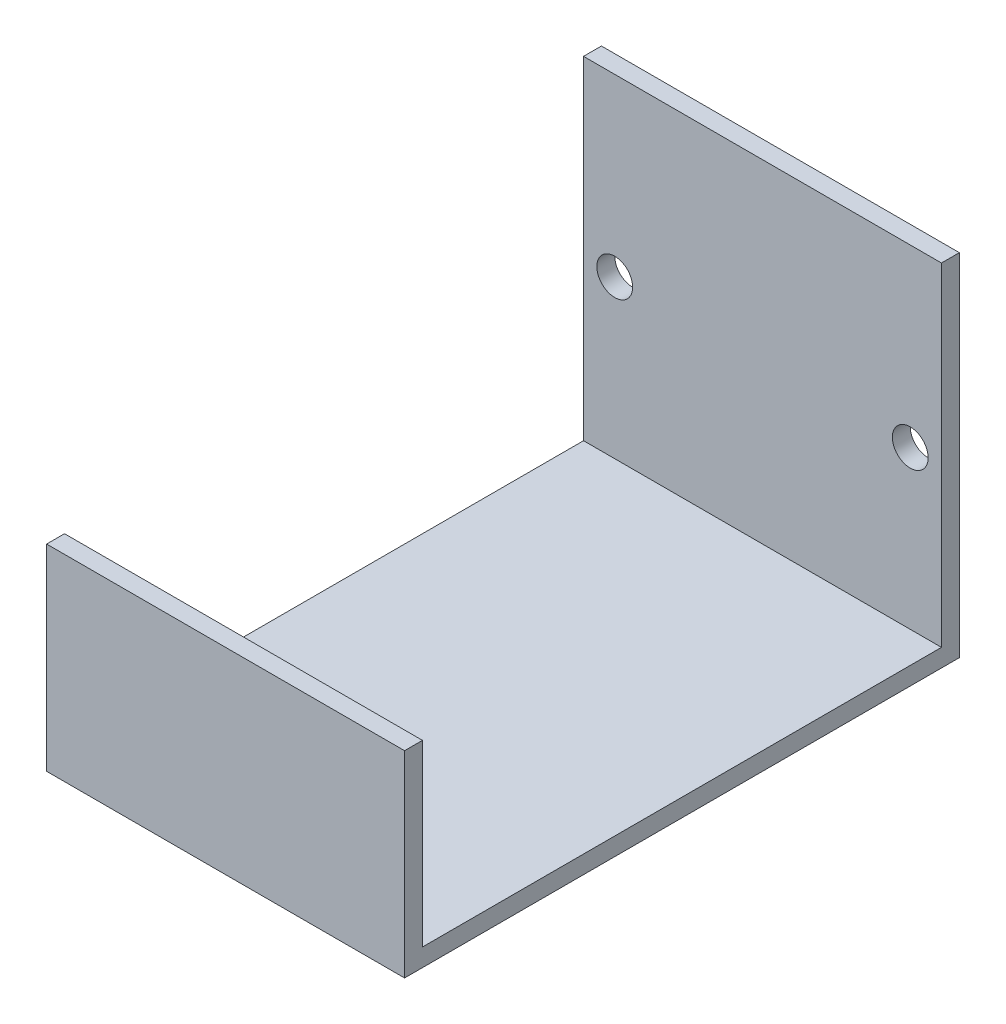
ISO-10303-21;
HEADER;
FILE_DESCRIPTION(('STEP AP214'),'2;1');
FILE_NAME('part.step','',(''),(''),'','','');
FILE_SCHEMA(('AUTOMOTIVE_DESIGN { 1 0 10303 214 1 1 1 1 }'));
ENDSEC;
DATA;
#1=APPLICATION_CONTEXT('core data for automotive mechanical design processes');
#2=APPLICATION_PROTOCOL_DEFINITION('international standard','automotive_design',2000,#1);
#3=PRODUCT_CONTEXT('',#1,'mechanical');
#4=PRODUCT('Part','Part','',(#3));
#5=PRODUCT_RELATED_PRODUCT_CATEGORY('part','',(#4));
#6=PRODUCT_DEFINITION_FORMATION('','',#4);
#7=PRODUCT_DEFINITION_CONTEXT('part definition',#1,'design');
#8=PRODUCT_DEFINITION('design','',#6,#7);
#9=PRODUCT_DEFINITION_SHAPE('','',#8);
#10=(LENGTH_UNIT() NAMED_UNIT(*) SI_UNIT(.MILLI.,.METRE.));
#11=(NAMED_UNIT(*) PLANE_ANGLE_UNIT() SI_UNIT($,.RADIAN.));
#12=(NAMED_UNIT(*) SI_UNIT($,.STERADIAN.) SOLID_ANGLE_UNIT());
#13=UNCERTAINTY_MEASURE_WITH_UNIT(LENGTH_MEASURE(1.E-05),#10,'distance_accuracy_value','');
#14=(GEOMETRIC_REPRESENTATION_CONTEXT(3) GLOBAL_UNCERTAINTY_ASSIGNED_CONTEXT((#13)) GLOBAL_UNIT_ASSIGNED_CONTEXT((#10,
#11,#12)) REPRESENTATION_CONTEXT('',''));
#15=CARTESIAN_POINT('',(0.,0.,0.));
#16=DIRECTION('',(0.,0.,1.));
#17=DIRECTION('',(1.,0.,0.));
#18=AXIS2_PLACEMENT_3D('',#15,#16,#17);
#19=CARTESIAN_POINT('',(-10.,-8.8,31.));
#20=DIRECTION('',(0.,-1.,0.));
#21=DIRECTION('',(0.,0.,-1.));
#22=AXIS2_PLACEMENT_3D('',#19,#20,#21);
#23=PLANE('',#22);
#24=DIRECTION('',(-1.,0.,0.));
#25=VECTOR('',#24,1.);
#26=CARTESIAN_POINT('',(10.,-8.8,30.));
#27=LINE('',#26,#25);
#28=CARTESIAN_POINT('',(10.,-8.8,30.));
#29=VERTEX_POINT('',#28);
#30=CARTESIAN_POINT('',(-10.,-8.8,30.));
#31=VERTEX_POINT('',#30);
#32=EDGE_CURVE('E165',#29,#31,#27,.T.);
#33=ORIENTED_EDGE('',*,*,#32,.F.);
#34=DIRECTION('',(0.,0.,-1.));
#35=VECTOR('',#34,1.);
#36=CARTESIAN_POINT('',(10.,-8.8,31.));
#37=LINE('',#36,#35);
#38=CARTESIAN_POINT('',(10.,-8.8,1.));
#39=VERTEX_POINT('',#38);
#40=EDGE_CURVE('E36',#29,#39,#37,.T.);
#41=ORIENTED_EDGE('',*,*,#40,.T.);
#42=DIRECTION('',(-1.,0.,0.));
#43=VECTOR('',#42,1.);
#44=CARTESIAN_POINT('',(-10.,-8.8,1.));
#45=LINE('',#44,#43);
#46=CARTESIAN_POINT('',(-10.,-8.8,1.));
#47=VERTEX_POINT('',#46);
#48=EDGE_CURVE('E127',#39,#47,#45,.T.);
#49=ORIENTED_EDGE('',*,*,#48,.T.);
#50=DIRECTION('',(0.,0.,-1.));
#51=VECTOR('',#50,1.);
#52=CARTESIAN_POINT('',(-10.,-8.8,31.));
#53=LINE('',#52,#51);
#54=EDGE_CURVE('E135',#31,#47,#53,.T.);
#55=ORIENTED_EDGE('',*,*,#54,.F.);
#56=EDGE_LOOP('',(#33,#41,#49,#55));
#57=FACE_BOUND('',#56,.T.);
#58=ADVANCED_FACE('F32',(#57),#23,.F.);
#59=CARTESIAN_POINT('',(0.,0.,1.));
#60=DIRECTION('',(0.,0.,-1.));
#61=DIRECTION('',(-1.,0.,0.));
#62=AXIS2_PLACEMENT_3D('',#59,#60,#61);
#63=PLANE('',#62);
#64=CARTESIAN_POINT('',(8.256,0.,1.));
#65=DIRECTION('',(0.,0.,1.));
#66=DIRECTION('',(1.,0.,0.));
#67=AXIS2_PLACEMENT_3D('',#64,#65,#66);
#68=CIRCLE('',#67,1.);
#69=CARTESIAN_POINT('',(9.256,0.,1.));
#70=VERTEX_POINT('',#69);
#71=EDGE_CURVE('E151',#70,#70,#68,.T.);
#72=ORIENTED_EDGE('',*,*,#71,.F.);
#73=EDGE_LOOP('',(#72));
#74=FACE_BOUND('',#73,.T.);
#75=CARTESIAN_POINT('',(-8.256,0.,1.));
#76=DIRECTION('',(0.,0.,1.));
#77=DIRECTION('',(1.,0.,0.));
#78=AXIS2_PLACEMENT_3D('',#75,#76,#77);
#79=CIRCLE('',#78,1.);
#80=CARTESIAN_POINT('',(-7.256,0.,1.));
#81=VERTEX_POINT('',#80);
#82=EDGE_CURVE('E105',#81,#81,#79,.T.);
#83=ORIENTED_EDGE('',*,*,#82,.F.);
#84=EDGE_LOOP('',(#83));
#85=FACE_BOUND('',#84,.T.);
#86=ORIENTED_EDGE('',*,*,#48,.F.);
#87=DIRECTION('',(0.,1.,0.));
#88=VECTOR('',#87,1.);
#89=CARTESIAN_POINT('',(10.,-9.8,1.));
#90=LINE('',#89,#88);
#91=CARTESIAN_POINT('',(10.,9.8,1.));
#92=VERTEX_POINT('',#91);
#93=EDGE_CURVE('E89',#39,#92,#90,.T.);
#94=ORIENTED_EDGE('',*,*,#93,.T.);
#95=DIRECTION('',(-1.,0.,0.));
#96=VECTOR('',#95,1.);
#97=CARTESIAN_POINT('',(-10.,9.8,1.));
#98=LINE('',#97,#96);
#99=CARTESIAN_POINT('',(-10.,9.8,1.));
#100=VERTEX_POINT('',#99);
#101=EDGE_CURVE('E58',#92,#100,#98,.T.);
#102=ORIENTED_EDGE('',*,*,#101,.T.);
#103=DIRECTION('',(0.,-1.,0.));
#104=VECTOR('',#103,1.);
#105=CARTESIAN_POINT('',(-10.,-9.8,1.));
#106=LINE('',#105,#104);
#107=EDGE_CURVE('E100',#100,#47,#106,.T.);
#108=ORIENTED_EDGE('',*,*,#107,.T.);
#109=EDGE_LOOP('',(#86,#94,#102,#108));
#110=FACE_BOUND('',#109,.T.);
#111=ADVANCED_FACE('F126',(#74,#85,#110),#63,.F.);
#112=CARTESIAN_POINT('',(0.,0.,0.));
#113=DIRECTION('',(0.,0.,-1.));
#114=DIRECTION('',(-1.,0.,0.));
#115=AXIS2_PLACEMENT_3D('',#112,#113,#114);
#116=PLANE('',#115);
#117=CARTESIAN_POINT('',(-8.256,0.,0.));
#118=DIRECTION('',(0.,0.,1.));
#119=DIRECTION('',(1.,0.,0.));
#120=AXIS2_PLACEMENT_3D('',#117,#118,#119);
#121=CIRCLE('',#120,1.);
#122=CARTESIAN_POINT('',(-7.256,0.,0.));
#123=VERTEX_POINT('',#122);
#124=EDGE_CURVE('E109',#123,#123,#121,.T.);
#125=ORIENTED_EDGE('',*,*,#124,.T.);
#126=EDGE_LOOP('',(#125));
#127=FACE_BOUND('',#126,.T.);
#128=DIRECTION('',(0.,1.,0.));
#129=VECTOR('',#128,1.);
#130=CARTESIAN_POINT('',(10.,-9.8,0.));
#131=LINE('',#130,#129);
#132=CARTESIAN_POINT('',(10.,-9.8,0.));
#133=VERTEX_POINT('',#132);
#134=CARTESIAN_POINT('',(10.,9.8,0.));
#135=VERTEX_POINT('',#134);
#136=EDGE_CURVE('E96',#133,#135,#131,.T.);
#137=ORIENTED_EDGE('',*,*,#136,.F.);
#138=DIRECTION('',(1.,0.,0.));
#139=VECTOR('',#138,1.);
#140=CARTESIAN_POINT('',(-10.,-9.8,0.));
#141=LINE('',#140,#139);
#142=CARTESIAN_POINT('',(-10.,-9.8,0.));
#143=VERTEX_POINT('',#142);
#144=EDGE_CURVE('E78',#143,#133,#141,.T.);
#145=ORIENTED_EDGE('',*,*,#144,.F.);
#146=DIRECTION('',(0.,-1.,0.));
#147=VECTOR('',#146,1.);
#148=CARTESIAN_POINT('',(-10.,-9.8,0.));
#149=LINE('',#148,#147);
#150=CARTESIAN_POINT('',(-10.,9.8,0.));
#151=VERTEX_POINT('',#150);
#152=EDGE_CURVE('E90',#151,#143,#149,.T.);
#153=ORIENTED_EDGE('',*,*,#152,.F.);
#154=DIRECTION('',(-1.,0.,0.));
#155=VECTOR('',#154,1.);
#156=CARTESIAN_POINT('',(-10.,9.8,0.));
#157=LINE('',#156,#155);
#158=EDGE_CURVE('E104',#135,#151,#157,.T.);
#159=ORIENTED_EDGE('',*,*,#158,.F.);
#160=EDGE_LOOP('',(#137,#145,#153,#159));
#161=FACE_BOUND('',#160,.T.);
#162=CARTESIAN_POINT('',(8.256,0.,0.));
#163=DIRECTION('',(0.,0.,1.));
#164=DIRECTION('',(1.,0.,0.));
#165=AXIS2_PLACEMENT_3D('',#162,#163,#164);
#166=CIRCLE('',#165,1.);
#167=CARTESIAN_POINT('',(9.256,0.,0.));
#168=VERTEX_POINT('',#167);
#169=EDGE_CURVE('E154',#168,#168,#166,.T.);
#170=ORIENTED_EDGE('',*,*,#169,.T.);
#171=EDGE_LOOP('',(#170));
#172=FACE_BOUND('',#171,.T.);
#173=ADVANCED_FACE('F102',(#127,#161,#172),#116,.T.);
#174=CARTESIAN_POINT('',(10.,-9.8,1.));
#175=DIRECTION('',(-1.,0.,0.));
#176=DIRECTION('',(0.,0.,1.));
#177=AXIS2_PLACEMENT_3D('',#174,#175,#176);
#178=PLANE('',#177);
#179=ORIENTED_EDGE('',*,*,#136,.T.);
#180=DIRECTION('',(0.,0.,-1.));
#181=VECTOR('',#180,1.);
#182=CARTESIAN_POINT('',(10.,9.8,1.));
#183=LINE('',#182,#181);
#184=EDGE_CURVE('E11',#92,#135,#183,.T.);
#185=ORIENTED_EDGE('',*,*,#184,.F.);
#186=ORIENTED_EDGE('',*,*,#93,.F.);
#187=ORIENTED_EDGE('',*,*,#40,.F.);
#188=DIRECTION('',(0.,-1.,0.));
#189=VECTOR('',#188,1.);
#190=CARTESIAN_POINT('',(10.,1.2,30.));
#191=LINE('',#190,#189);
#192=CARTESIAN_POINT('',(10.,1.2,30.));
#193=VERTEX_POINT('',#192);
#194=EDGE_CURVE('E137',#193,#29,#191,.T.);
#195=ORIENTED_EDGE('',*,*,#194,.F.);
#196=DIRECTION('',(0.,0.,-1.));
#197=VECTOR('',#196,1.);
#198=CARTESIAN_POINT('',(10.,1.2,31.));
#199=LINE('',#198,#197);
#200=CARTESIAN_POINT('',(10.,1.2,31.));
#201=VERTEX_POINT('',#200);
#202=EDGE_CURVE('E168',#201,#193,#199,.T.);
#203=ORIENTED_EDGE('',*,*,#202,.F.);
#204=DIRECTION('',(0.,1.,0.));
#205=VECTOR('',#204,1.);
#206=CARTESIAN_POINT('',(10.,-9.8,31.));
#207=LINE('',#206,#205);
#208=CARTESIAN_POINT('',(10.,-9.8,31.));
#209=VERTEX_POINT('',#208);
#210=EDGE_CURVE('E99',#209,#201,#207,.T.);
#211=ORIENTED_EDGE('',*,*,#210,.F.);
#212=DIRECTION('',(0.,0.,-1.));
#213=VECTOR('',#212,1.);
#214=CARTESIAN_POINT('',(10.,-9.8,1.));
#215=LINE('',#214,#213);
#216=EDGE_CURVE('E82',#209,#133,#215,.T.);
#217=ORIENTED_EDGE('',*,*,#216,.T.);
#218=EDGE_LOOP('',(#179,#185,#186,#187,#195,#203,#211,#217));
#219=FACE_BOUND('',#218,.T.);
#220=ADVANCED_FACE('F34',(#219),#178,.F.);
#221=CARTESIAN_POINT('',(-10.,9.8,1.));
#222=DIRECTION('',(0.,-1.,0.));
#223=DIRECTION('',(0.,0.,-1.));
#224=AXIS2_PLACEMENT_3D('',#221,#222,#223);
#225=PLANE('',#224);
#226=ORIENTED_EDGE('',*,*,#158,.T.);
#227=DIRECTION('',(0.,0.,-1.));
#228=VECTOR('',#227,1.);
#229=CARTESIAN_POINT('',(-10.,9.8,1.));
#230=LINE('',#229,#228);
#231=EDGE_CURVE('E42',#100,#151,#230,.T.);
#232=ORIENTED_EDGE('',*,*,#231,.F.);
#233=ORIENTED_EDGE('',*,*,#101,.F.);
#234=ORIENTED_EDGE('',*,*,#184,.T.);
#235=EDGE_LOOP('',(#226,#232,#233,#234));
#236=FACE_BOUND('',#235,.T.);
#237=ADVANCED_FACE('F228',(#236),#225,.F.);
#238=CARTESIAN_POINT('',(-10.,-9.8,1.));
#239=DIRECTION('',(1.,0.,0.));
#240=DIRECTION('',(0.,0.,-1.));
#241=AXIS2_PLACEMENT_3D('',#238,#239,#240);
#242=PLANE('',#241);
#243=ORIENTED_EDGE('',*,*,#152,.T.);
#244=DIRECTION('',(0.,0.,-1.));
#245=VECTOR('',#244,1.);
#246=CARTESIAN_POINT('',(-10.,-9.8,1.));
#247=LINE('',#246,#245);
#248=CARTESIAN_POINT('',(-10.,-9.8,31.));
#249=VERTEX_POINT('',#248);
#250=EDGE_CURVE('E85',#249,#143,#247,.T.);
#251=ORIENTED_EDGE('',*,*,#250,.F.);
#252=DIRECTION('',(0.,-1.,0.));
#253=VECTOR('',#252,1.);
#254=CARTESIAN_POINT('',(-10.,-9.8,31.));
#255=LINE('',#254,#253);
#256=CARTESIAN_POINT('',(-10.,1.2,31.));
#257=VERTEX_POINT('',#256);
#258=EDGE_CURVE('E136',#257,#249,#255,.T.);
#259=ORIENTED_EDGE('',*,*,#258,.F.);
#260=DIRECTION('',(0.,0.,1.));
#261=VECTOR('',#260,1.);
#262=CARTESIAN_POINT('',(-10.,1.2,31.));
#263=LINE('',#262,#261);
#264=CARTESIAN_POINT('',(-10.,1.2,30.));
#265=VERTEX_POINT('',#264);
#266=EDGE_CURVE('E170',#265,#257,#263,.T.);
#267=ORIENTED_EDGE('',*,*,#266,.F.);
#268=DIRECTION('',(0.,-1.,0.));
#269=VECTOR('',#268,1.);
#270=CARTESIAN_POINT('',(-10.,1.2,30.));
#271=LINE('',#270,#269);
#272=EDGE_CURVE('E142',#265,#31,#271,.T.);
#273=ORIENTED_EDGE('',*,*,#272,.T.);
#274=ORIENTED_EDGE('',*,*,#54,.T.);
#275=ORIENTED_EDGE('',*,*,#107,.F.);
#276=ORIENTED_EDGE('',*,*,#231,.T.);
#277=EDGE_LOOP('',(#243,#251,#259,#267,#273,#274,#275,#276));
#278=FACE_BOUND('',#277,.T.);
#279=ADVANCED_FACE('F195',(#278),#242,.F.);
#280=CARTESIAN_POINT('',(-10.,-9.8,1.));
#281=DIRECTION('',(0.,1.,0.));
#282=DIRECTION('',(0.,0.,1.));
#283=AXIS2_PLACEMENT_3D('',#280,#281,#282);
#284=PLANE('',#283);
#285=ORIENTED_EDGE('',*,*,#144,.T.);
#286=ORIENTED_EDGE('',*,*,#216,.F.);
#287=DIRECTION('',(1.,0.,0.));
#288=VECTOR('',#287,1.);
#289=CARTESIAN_POINT('',(-10.,-9.8,31.));
#290=LINE('',#289,#288);
#291=EDGE_CURVE('E139',#249,#209,#290,.T.);
#292=ORIENTED_EDGE('',*,*,#291,.F.);
#293=ORIENTED_EDGE('',*,*,#250,.T.);
#294=EDGE_LOOP('',(#285,#286,#292,#293));
#295=FACE_BOUND('',#294,.T.);
#296=ADVANCED_FACE('F80',(#295),#284,.F.);
#297=CARTESIAN_POINT('',(-8.256,0.,1.));
#298=DIRECTION('',(0.,0.,-1.));
#299=DIRECTION('',(-1.,0.,0.));
#300=AXIS2_PLACEMENT_3D('',#297,#298,#299);
#301=CYLINDRICAL_SURFACE('',#300,1.);
#302=ORIENTED_EDGE('',*,*,#82,.T.);
#303=EDGE_LOOP('',(#302));
#304=FACE_BOUND('',#303,.T.);
#305=ORIENTED_EDGE('',*,*,#124,.F.);
#306=EDGE_LOOP('',(#305));
#307=FACE_BOUND('',#306,.T.);
#308=ADVANCED_FACE('F208',(#304,#307),#301,.F.);
#309=CARTESIAN_POINT('',(8.256,0.,1.));
#310=DIRECTION('',(0.,0.,-1.));
#311=DIRECTION('',(-1.,0.,0.));
#312=AXIS2_PLACEMENT_3D('',#309,#310,#311);
#313=CYLINDRICAL_SURFACE('',#312,1.);
#314=ORIENTED_EDGE('',*,*,#71,.T.);
#315=EDGE_LOOP('',(#314));
#316=FACE_BOUND('',#315,.T.);
#317=ORIENTED_EDGE('',*,*,#169,.F.);
#318=EDGE_LOOP('',(#317));
#319=FACE_BOUND('',#318,.T.);
#320=ADVANCED_FACE('F201',(#316,#319),#313,.F.);
#321=CARTESIAN_POINT('',(0.,0.,31.));
#322=DIRECTION('',(0.,0.,-1.));
#323=DIRECTION('',(-1.,0.,0.));
#324=AXIS2_PLACEMENT_3D('',#321,#322,#323);
#325=PLANE('',#324);
#326=ORIENTED_EDGE('',*,*,#258,.T.);
#327=ORIENTED_EDGE('',*,*,#291,.T.);
#328=ORIENTED_EDGE('',*,*,#210,.T.);
#329=DIRECTION('',(1.,0.,0.));
#330=VECTOR('',#329,1.);
#331=CARTESIAN_POINT('',(10.,1.2,31.));
#332=LINE('',#331,#330);
#333=EDGE_CURVE('E164',#257,#201,#332,.T.);
#334=ORIENTED_EDGE('',*,*,#333,.F.);
#335=EDGE_LOOP('',(#326,#327,#328,#334));
#336=FACE_BOUND('',#335,.T.);
#337=ADVANCED_FACE('F198',(#336),#325,.F.);
#338=CARTESIAN_POINT('',(10.,1.2,30.));
#339=DIRECTION('',(0.,0.,1.));
#340=DIRECTION('',(1.,0.,0.));
#341=AXIS2_PLACEMENT_3D('',#338,#339,#340);
#342=PLANE('',#341);
#343=ORIENTED_EDGE('',*,*,#32,.T.);
#344=ORIENTED_EDGE('',*,*,#272,.F.);
#345=DIRECTION('',(-1.,0.,0.));
#346=VECTOR('',#345,1.);
#347=CARTESIAN_POINT('',(10.,1.2,30.));
#348=LINE('',#347,#346);
#349=EDGE_CURVE('E173',#193,#265,#348,.T.);
#350=ORIENTED_EDGE('',*,*,#349,.F.);
#351=ORIENTED_EDGE('',*,*,#194,.T.);
#352=EDGE_LOOP('',(#343,#344,#350,#351));
#353=FACE_BOUND('',#352,.T.);
#354=ADVANCED_FACE('F187',(#353),#342,.F.);
#355=CARTESIAN_POINT('',(0.,1.2,0.));
#356=DIRECTION('',(0.,1.,0.));
#357=DIRECTION('',(0.,0.,1.));
#358=AXIS2_PLACEMENT_3D('',#355,#356,#357);
#359=PLANE('',#358);
#360=ORIENTED_EDGE('',*,*,#202,.T.);
#361=ORIENTED_EDGE('',*,*,#349,.T.);
#362=ORIENTED_EDGE('',*,*,#266,.T.);
#363=ORIENTED_EDGE('',*,*,#333,.T.);
#364=EDGE_LOOP('',(#360,#361,#362,#363));
#365=FACE_BOUND('',#364,.T.);
#366=ADVANCED_FACE('F180',(#365),#359,.T.);
#367=CLOSED_SHELL('',(#58,#111,#173,#220,#237,#279,#296,#308,#320,#337,#354,#366));
#368=MANIFOLD_SOLID_BREP('B2',#367);
#369=ADVANCED_BREP_SHAPE_REPRESENTATION('',(#18,#368),#14);
#370=SHAPE_DEFINITION_REPRESENTATION(#9,#369);
ENDSEC;
END-ISO-10303-21;
